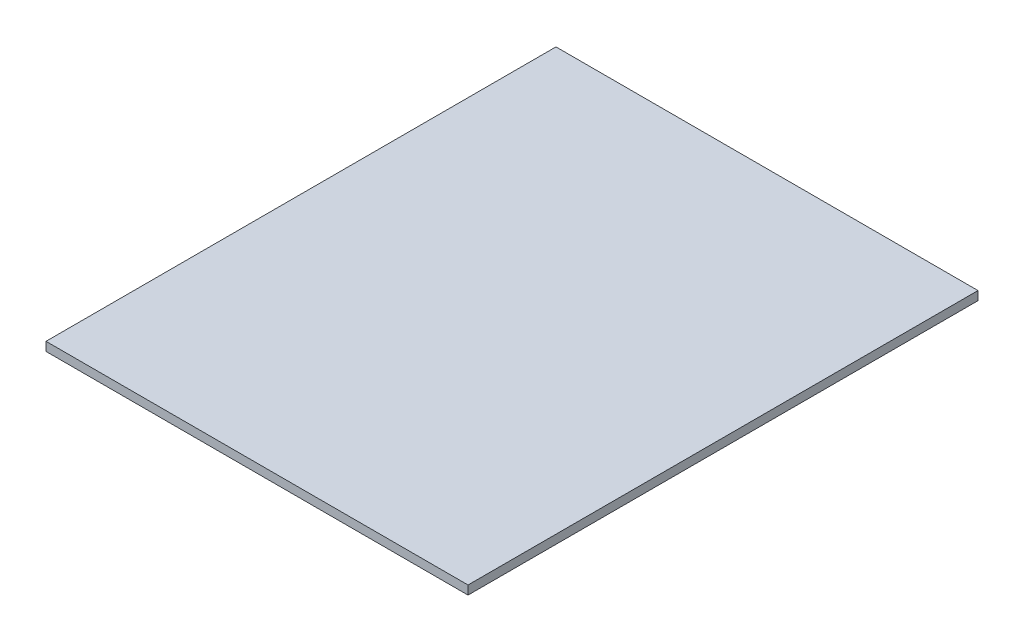
ISO-10303-21;
HEADER;
FILE_DESCRIPTION(('STEP AP214'),'2;1');
FILE_NAME('part.step','',(''),(''),'','','');
FILE_SCHEMA(('AUTOMOTIVE_DESIGN { 1 0 10303 214 1 1 1 1 }'));
ENDSEC;
DATA;
#1=APPLICATION_CONTEXT('core data for automotive mechanical design processes');
#2=APPLICATION_PROTOCOL_DEFINITION('international standard','automotive_design',2000,#1);
#3=PRODUCT_CONTEXT('',#1,'mechanical');
#4=PRODUCT('Part','Part','',(#3));
#5=PRODUCT_RELATED_PRODUCT_CATEGORY('part','',(#4));
#6=PRODUCT_DEFINITION_FORMATION('','',#4);
#7=PRODUCT_DEFINITION_CONTEXT('part definition',#1,'design');
#8=PRODUCT_DEFINITION('design','',#6,#7);
#9=PRODUCT_DEFINITION_SHAPE('','',#8);
#10=(LENGTH_UNIT() NAMED_UNIT(*) SI_UNIT(.MILLI.,.METRE.));
#11=(NAMED_UNIT(*) PLANE_ANGLE_UNIT() SI_UNIT($,.RADIAN.));
#12=(NAMED_UNIT(*) SI_UNIT($,.STERADIAN.) SOLID_ANGLE_UNIT());
#13=UNCERTAINTY_MEASURE_WITH_UNIT(LENGTH_MEASURE(1.E-05),#10,'distance_accuracy_value','');
#14=(GEOMETRIC_REPRESENTATION_CONTEXT(3) GLOBAL_UNCERTAINTY_ASSIGNED_CONTEXT((#13)) GLOBAL_UNIT_ASSIGNED_CONTEXT((#10,
#11,#12)) REPRESENTATION_CONTEXT('',''));
#15=CARTESIAN_POINT('',(0.,0.,0.));
#16=DIRECTION('',(0.,0.,1.));
#17=DIRECTION('',(1.,0.,0.));
#18=AXIS2_PLACEMENT_3D('',#15,#16,#17);
#19=CARTESIAN_POINT('',(-32.2226938585367,6.,-333.011164946951));
#20=DIRECTION('',(1.,0.,0.));
#21=DIRECTION('',(0.,0.,-1.));
#22=AXIS2_PLACEMENT_3D('',#19,#20,#21);
#23=PLANE('',#22);
#24=DIRECTION('',(0.,0.,1.));
#25=VECTOR('',#24,1.);
#26=CARTESIAN_POINT('',(-32.2226938585367,0.,-333.011164946951));
#27=LINE('',#26,#25);
#28=CARTESIAN_POINT('',(-32.2226938585367,0.,-333.011164946951));
#29=VERTEX_POINT('',#28);
#30=CARTESIAN_POINT('',(-32.2226938585366,0.,14.9888350530488));
#31=VERTEX_POINT('',#30);
#32=EDGE_CURVE('E99',#29,#31,#27,.T.);
#33=ORIENTED_EDGE('',*,*,#32,.T.);
#34=DIRECTION('',(0.,-1.,0.));
#35=VECTOR('',#34,1.);
#36=CARTESIAN_POINT('',(-32.2226938585366,6.,14.9888350530488));
#37=LINE('',#36,#35);
#38=CARTESIAN_POINT('',(-32.2226938585366,6.,14.9888350530488));
#39=VERTEX_POINT('',#38);
#40=EDGE_CURVE('E11',#39,#31,#37,.T.);
#41=ORIENTED_EDGE('',*,*,#40,.F.);
#42=DIRECTION('',(0.,0.,1.));
#43=VECTOR('',#42,1.);
#44=CARTESIAN_POINT('',(-32.2226938585367,6.,-333.011164946951));
#45=LINE('',#44,#43);
#46=CARTESIAN_POINT('',(-32.2226938585367,6.,-333.011164946951));
#47=VERTEX_POINT('',#46);
#48=EDGE_CURVE('E87',#47,#39,#45,.T.);
#49=ORIENTED_EDGE('',*,*,#48,.F.);
#50=DIRECTION('',(0.,-1.,0.));
#51=VECTOR('',#50,1.);
#52=CARTESIAN_POINT('',(-32.2226938585367,6.,-333.011164946951));
#53=LINE('',#52,#51);
#54=EDGE_CURVE('E95',#47,#29,#53,.T.);
#55=ORIENTED_EDGE('',*,*,#54,.T.);
#56=EDGE_LOOP('',(#33,#41,#49,#55));
#57=FACE_BOUND('',#56,.T.);
#58=ADVANCED_FACE('F36',(#57),#23,.F.);
#59=CARTESIAN_POINT('',(-32.2226938585366,6.,14.9888350530488));
#60=DIRECTION('',(0.,0.,-1.));
#61=DIRECTION('',(-1.,0.,0.));
#62=AXIS2_PLACEMENT_3D('',#59,#60,#61);
#63=PLANE('',#62);
#64=DIRECTION('',(1.,0.,0.));
#65=VECTOR('',#64,1.);
#66=CARTESIAN_POINT('',(-32.2226938585366,0.,14.9888350530488));
#67=LINE('',#66,#65);
#68=CARTESIAN_POINT('',(255.777306141463,0.,14.9888350530488));
#69=VERTEX_POINT('',#68);
#70=EDGE_CURVE('E91',#31,#69,#67,.T.);
#71=ORIENTED_EDGE('',*,*,#70,.T.);
#72=DIRECTION('',(0.,-1.,0.));
#73=VECTOR('',#72,1.);
#74=CARTESIAN_POINT('',(255.777306141463,6.,14.9888350530488));
#75=LINE('',#74,#73);
#76=CARTESIAN_POINT('',(255.777306141463,6.,14.9888350530488));
#77=VERTEX_POINT('',#76);
#78=EDGE_CURVE('E44',#77,#69,#75,.T.);
#79=ORIENTED_EDGE('',*,*,#78,.F.);
#80=DIRECTION('',(1.,0.,0.));
#81=VECTOR('',#80,1.);
#82=CARTESIAN_POINT('',(-32.2226938585366,6.,14.9888350530488));
#83=LINE('',#82,#81);
#84=EDGE_CURVE('E82',#39,#77,#83,.T.);
#85=ORIENTED_EDGE('',*,*,#84,.F.);
#86=ORIENTED_EDGE('',*,*,#40,.T.);
#87=EDGE_LOOP('',(#71,#79,#85,#86));
#88=FACE_BOUND('',#87,.T.);
#89=ADVANCED_FACE('F90',(#88),#63,.F.);
#90=CARTESIAN_POINT('',(255.777306141463,6.,-333.011164946951));
#91=DIRECTION('',(-1.,0.,0.));
#92=DIRECTION('',(0.,0.,1.));
#93=AXIS2_PLACEMENT_3D('',#90,#91,#92);
#94=PLANE('',#93);
#95=DIRECTION('',(0.,0.,-1.));
#96=VECTOR('',#95,1.);
#97=CARTESIAN_POINT('',(255.777306141463,0.,-333.011164946951));
#98=LINE('',#97,#96);
#99=CARTESIAN_POINT('',(255.777306141463,0.,-333.011164946951));
#100=VERTEX_POINT('',#99);
#101=EDGE_CURVE('E69',#69,#100,#98,.T.);
#102=ORIENTED_EDGE('',*,*,#101,.T.);
#103=DIRECTION('',(0.,-1.,0.));
#104=VECTOR('',#103,1.);
#105=CARTESIAN_POINT('',(255.777306141463,6.,-333.011164946951));
#106=LINE('',#105,#104);
#107=CARTESIAN_POINT('',(255.777306141463,6.,-333.011164946951));
#108=VERTEX_POINT('',#107);
#109=EDGE_CURVE('E92',#108,#100,#106,.T.);
#110=ORIENTED_EDGE('',*,*,#109,.F.);
#111=DIRECTION('',(0.,0.,-1.));
#112=VECTOR('',#111,1.);
#113=CARTESIAN_POINT('',(255.777306141463,6.,-333.011164946951));
#114=LINE('',#113,#112);
#115=EDGE_CURVE('E85',#77,#108,#114,.T.);
#116=ORIENTED_EDGE('',*,*,#115,.F.);
#117=ORIENTED_EDGE('',*,*,#78,.T.);
#118=EDGE_LOOP('',(#102,#110,#116,#117));
#119=FACE_BOUND('',#118,.T.);
#120=ADVANCED_FACE('F93',(#119),#94,.F.);
#121=CARTESIAN_POINT('',(-32.2226938585367,6.,-333.011164946951));
#122=DIRECTION('',(0.,0.,1.));
#123=DIRECTION('',(1.,0.,0.));
#124=AXIS2_PLACEMENT_3D('',#121,#122,#123);
#125=PLANE('',#124);
#126=DIRECTION('',(-1.,0.,0.));
#127=VECTOR('',#126,1.);
#128=CARTESIAN_POINT('',(-32.2226938585367,0.,-333.011164946951));
#129=LINE('',#128,#127);
#130=EDGE_CURVE('E75',#100,#29,#129,.T.);
#131=ORIENTED_EDGE('',*,*,#130,.T.);
#132=ORIENTED_EDGE('',*,*,#54,.F.);
#133=DIRECTION('',(-1.,0.,0.));
#134=VECTOR('',#133,1.);
#135=CARTESIAN_POINT('',(-32.2226938585367,6.,-333.011164946951));
#136=LINE('',#135,#134);
#137=EDGE_CURVE('E52',#108,#47,#136,.T.);
#138=ORIENTED_EDGE('',*,*,#137,.F.);
#139=ORIENTED_EDGE('',*,*,#109,.T.);
#140=EDGE_LOOP('',(#131,#132,#138,#139));
#141=FACE_BOUND('',#140,.T.);
#142=ADVANCED_FACE('F106',(#141),#125,.F.);
#143=CARTESIAN_POINT('',(0.,6.,0.));
#144=DIRECTION('',(0.,1.,0.));
#145=DIRECTION('',(0.,0.,1.));
#146=AXIS2_PLACEMENT_3D('',#143,#144,#145);
#147=PLANE('',#146);
#148=ORIENTED_EDGE('',*,*,#48,.T.);
#149=ORIENTED_EDGE('',*,*,#84,.T.);
#150=ORIENTED_EDGE('',*,*,#115,.T.);
#151=ORIENTED_EDGE('',*,*,#137,.T.);
#152=EDGE_LOOP('',(#148,#149,#150,#151));
#153=FACE_BOUND('',#152,.T.);
#154=ADVANCED_FACE('F83',(#153),#147,.T.);
#155=CARTESIAN_POINT('',(0.,0.,0.));
#156=DIRECTION('',(0.,1.,0.));
#157=DIRECTION('',(0.,0.,1.));
#158=AXIS2_PLACEMENT_3D('',#155,#156,#157);
#159=PLANE('',#158);
#160=ORIENTED_EDGE('',*,*,#32,.F.);
#161=ORIENTED_EDGE('',*,*,#130,.F.);
#162=ORIENTED_EDGE('',*,*,#101,.F.);
#163=ORIENTED_EDGE('',*,*,#70,.F.);
#164=EDGE_LOOP('',(#160,#161,#162,#163));
#165=FACE_BOUND('',#164,.T.);
#166=ADVANCED_FACE('F109',(#165),#159,.F.);
#167=CLOSED_SHELL('',(#58,#89,#120,#142,#154,#166));
#168=MANIFOLD_SOLID_BREP('B2',#167);
#169=ADVANCED_BREP_SHAPE_REPRESENTATION('',(#18,#168),#14);
#170=SHAPE_DEFINITION_REPRESENTATION(#9,#169);
ENDSEC;
END-ISO-10303-21;
